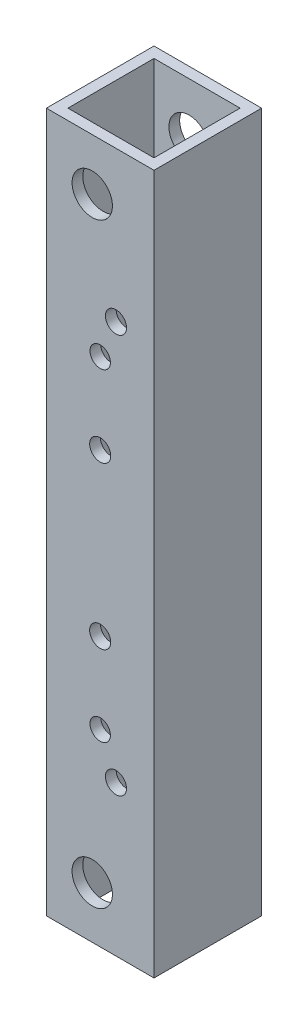
ISO-10303-21;
HEADER;
FILE_DESCRIPTION(('STEP AP214'),'2;1');
FILE_NAME('part.step','',(''),(''),'','','');
FILE_SCHEMA(('AUTOMOTIVE_DESIGN { 1 0 10303 214 1 1 1 1 }'));
ENDSEC;
DATA;
#1=APPLICATION_CONTEXT('core data for automotive mechanical design processes');
#2=APPLICATION_PROTOCOL_DEFINITION('international standard','automotive_design',2000,#1);
#3=PRODUCT_CONTEXT('',#1,'mechanical');
#4=PRODUCT('Part','Part','',(#3));
#5=PRODUCT_RELATED_PRODUCT_CATEGORY('part','',(#4));
#6=PRODUCT_DEFINITION_FORMATION('','',#4);
#7=PRODUCT_DEFINITION_CONTEXT('part definition',#1,'design');
#8=PRODUCT_DEFINITION('design','',#6,#7);
#9=PRODUCT_DEFINITION_SHAPE('','',#8);
#10=(LENGTH_UNIT() NAMED_UNIT(*) SI_UNIT(.MILLI.,.METRE.));
#11=(NAMED_UNIT(*) PLANE_ANGLE_UNIT() SI_UNIT($,.RADIAN.));
#12=(NAMED_UNIT(*) SI_UNIT($,.STERADIAN.) SOLID_ANGLE_UNIT());
#13=UNCERTAINTY_MEASURE_WITH_UNIT(LENGTH_MEASURE(1.E-05),#10,'distance_accuracy_value','');
#14=(GEOMETRIC_REPRESENTATION_CONTEXT(3) GLOBAL_UNCERTAINTY_ASSIGNED_CONTEXT((#13)) GLOBAL_UNIT_ASSIGNED_CONTEXT((#10,
#11,#12)) REPRESENTATION_CONTEXT('',''));
#15=CARTESIAN_POINT('',(0.,0.,0.));
#16=DIRECTION('',(0.,0.,1.));
#17=DIRECTION('',(1.,0.,0.));
#18=AXIS2_PLACEMENT_3D('',#15,#16,#17);
#19=CARTESIAN_POINT('',(25.4,0.,25.4));
#20=DIRECTION('',(0.,1.,0.));
#21=DIRECTION('',(-1.,0.,0.));
#22=AXIS2_PLACEMENT_3D('',#19,#20,#21);
#23=PLANE('',#22);
#24=DIRECTION('',(1.,0.,0.));
#25=VECTOR('',#24,1.);
#26=CARTESIAN_POINT('',(0.,0.,22.86));
#27=LINE('',#26,#25);
#28=CARTESIAN_POINT('',(2.54000000000001,0.,22.86));
#29=VERTEX_POINT('',#28);
#30=CARTESIAN_POINT('',(22.86,0.,22.86));
#31=VERTEX_POINT('',#30);
#32=EDGE_CURVE('E106',#29,#31,#27,.T.);
#33=ORIENTED_EDGE('',*,*,#32,.T.);
#34=DIRECTION('',(0.,0.,-1.));
#35=VECTOR('',#34,1.);
#36=CARTESIAN_POINT('',(22.86,0.,0.));
#37=LINE('',#36,#35);
#38=CARTESIAN_POINT('',(22.86,0.,2.54));
#39=VERTEX_POINT('',#38);
#40=EDGE_CURVE('E100',#31,#39,#37,.T.);
#41=ORIENTED_EDGE('',*,*,#40,.T.);
#42=DIRECTION('',(-1.,0.,0.));
#43=VECTOR('',#42,1.);
#44=CARTESIAN_POINT('',(0.,0.,2.54));
#45=LINE('',#44,#43);
#46=CARTESIAN_POINT('',(2.54,0.,2.54));
#47=VERTEX_POINT('',#46);
#48=EDGE_CURVE('E109',#39,#47,#45,.T.);
#49=ORIENTED_EDGE('',*,*,#48,.T.);
#50=DIRECTION('',(0.,0.,1.));
#51=VECTOR('',#50,1.);
#52=CARTESIAN_POINT('',(2.54,0.,0.));
#53=LINE('',#52,#51);
#54=EDGE_CURVE('E48',#47,#29,#53,.T.);
#55=ORIENTED_EDGE('',*,*,#54,.T.);
#56=EDGE_LOOP('',(#33,#41,#49,#55));
#57=FACE_BOUND('',#56,.T.);
#58=DIRECTION('',(1.,0.,0.));
#59=VECTOR('',#58,1.);
#60=CARTESIAN_POINT('',(25.4,0.,0.));
#61=LINE('',#60,#59);
#62=CARTESIAN_POINT('',(0.,0.,0.));
#63=VERTEX_POINT('',#62);
#64=CARTESIAN_POINT('',(25.4,0.,0.));
#65=VERTEX_POINT('',#64);
#66=EDGE_CURVE('E133',#63,#65,#61,.T.);
#67=ORIENTED_EDGE('',*,*,#66,.T.);
#68=DIRECTION('',(0.,0.,-1.));
#69=VECTOR('',#68,1.);
#70=CARTESIAN_POINT('',(25.4,0.,25.4));
#71=LINE('',#70,#69);
#72=CARTESIAN_POINT('',(25.4,0.,25.4));
#73=VERTEX_POINT('',#72);
#74=EDGE_CURVE('E11',#73,#65,#71,.T.);
#75=ORIENTED_EDGE('',*,*,#74,.F.);
#76=DIRECTION('',(1.,0.,0.));
#77=VECTOR('',#76,1.);
#78=CARTESIAN_POINT('',(25.4,0.,25.4));
#79=LINE('',#78,#77);
#80=CARTESIAN_POINT('',(0.,0.,25.4));
#81=VERTEX_POINT('',#80);
#82=EDGE_CURVE('E137',#81,#73,#79,.T.);
#83=ORIENTED_EDGE('',*,*,#82,.F.);
#84=DIRECTION('',(0.,0.,-1.));
#85=VECTOR('',#84,1.);
#86=CARTESIAN_POINT('',(0.,0.,25.4));
#87=LINE('',#86,#85);
#88=EDGE_CURVE('E147',#81,#63,#87,.T.);
#89=ORIENTED_EDGE('',*,*,#88,.T.);
#90=EDGE_LOOP('',(#67,#75,#83,#89));
#91=FACE_BOUND('',#90,.T.);
#92=ADVANCED_FACE('F32',(#57,#91),#23,.F.);
#93=CARTESIAN_POINT('',(25.4,165.1,25.4));
#94=DIRECTION('',(-1.,0.,0.));
#95=DIRECTION('',(0.,-1.,0.));
#96=AXIS2_PLACEMENT_3D('',#93,#94,#95);
#97=PLANE('',#96);
#98=DIRECTION('',(0.,1.,0.));
#99=VECTOR('',#98,1.);
#100=CARTESIAN_POINT('',(25.4,165.1,0.));
#101=LINE('',#100,#99);
#102=CARTESIAN_POINT('',(25.4,165.1,0.));
#103=VERTEX_POINT('',#102);
#104=EDGE_CURVE('E150',#65,#103,#101,.T.);
#105=ORIENTED_EDGE('',*,*,#104,.T.);
#106=DIRECTION('',(0.,0.,-1.));
#107=VECTOR('',#106,1.);
#108=CARTESIAN_POINT('',(25.4,165.1,25.4));
#109=LINE('',#108,#107);
#110=CARTESIAN_POINT('',(25.4,165.1,25.4));
#111=VERTEX_POINT('',#110);
#112=EDGE_CURVE('E40',#111,#103,#109,.T.);
#113=ORIENTED_EDGE('',*,*,#112,.F.);
#114=DIRECTION('',(0.,1.,0.));
#115=VECTOR('',#114,1.);
#116=CARTESIAN_POINT('',(25.4,165.1,25.4));
#117=LINE('',#116,#115);
#118=EDGE_CURVE('E140',#73,#111,#117,.T.);
#119=ORIENTED_EDGE('',*,*,#118,.F.);
#120=ORIENTED_EDGE('',*,*,#74,.T.);
#121=EDGE_LOOP('',(#105,#113,#119,#120));
#122=FACE_BOUND('',#121,.T.);
#123=ADVANCED_FACE('F233',(#122),#97,.F.);
#124=CARTESIAN_POINT('',(0.,165.1,25.4));
#125=DIRECTION('',(0.,-1.,0.));
#126=DIRECTION('',(0.,0.,-1.));
#127=AXIS2_PLACEMENT_3D('',#124,#125,#126);
#128=PLANE('',#127);
#129=DIRECTION('',(-1.,0.,0.));
#130=VECTOR('',#129,1.);
#131=CARTESIAN_POINT('',(0.,165.1,2.54));
#132=LINE('',#131,#130);
#133=CARTESIAN_POINT('',(22.86,165.1,2.54));
#134=VERTEX_POINT('',#133);
#135=CARTESIAN_POINT('',(2.54,165.1,2.54));
#136=VERTEX_POINT('',#135);
#137=EDGE_CURVE('E127',#134,#136,#132,.T.);
#138=ORIENTED_EDGE('',*,*,#137,.F.);
#139=DIRECTION('',(0.,0.,-1.));
#140=VECTOR('',#139,1.);
#141=CARTESIAN_POINT('',(22.86,165.1,0.));
#142=LINE('',#141,#140);
#143=CARTESIAN_POINT('',(22.86,165.1,22.86));
#144=VERTEX_POINT('',#143);
#145=EDGE_CURVE('E56',#144,#134,#142,.T.);
#146=ORIENTED_EDGE('',*,*,#145,.F.);
#147=DIRECTION('',(1.,0.,0.));
#148=VECTOR('',#147,1.);
#149=CARTESIAN_POINT('',(0.,165.1,22.86));
#150=LINE('',#149,#148);
#151=CARTESIAN_POINT('',(2.54000000000001,165.1,22.86));
#152=VERTEX_POINT('',#151);
#153=EDGE_CURVE('E115',#152,#144,#150,.T.);
#154=ORIENTED_EDGE('',*,*,#153,.F.);
#155=DIRECTION('',(0.,0.,1.));
#156=VECTOR('',#155,1.);
#157=CARTESIAN_POINT('',(2.54,165.1,0.));
#158=LINE('',#157,#156);
#159=EDGE_CURVE('E118',#136,#152,#158,.T.);
#160=ORIENTED_EDGE('',*,*,#159,.F.);
#161=EDGE_LOOP('',(#138,#146,#154,#160));
#162=FACE_BOUND('',#161,.T.);
#163=DIRECTION('',(-1.,0.,0.));
#164=VECTOR('',#163,1.);
#165=CARTESIAN_POINT('',(0.,165.1,0.));
#166=LINE('',#165,#164);
#167=CARTESIAN_POINT('',(0.,165.1,0.));
#168=VERTEX_POINT('',#167);
#169=EDGE_CURVE('E152',#103,#168,#166,.T.);
#170=ORIENTED_EDGE('',*,*,#169,.T.);
#171=DIRECTION('',(0.,0.,-1.));
#172=VECTOR('',#171,1.);
#173=CARTESIAN_POINT('',(0.,165.1,25.4));
#174=LINE('',#173,#172);
#175=CARTESIAN_POINT('',(0.,165.1,25.4));
#176=VERTEX_POINT('',#175);
#177=EDGE_CURVE('E157',#176,#168,#174,.T.);
#178=ORIENTED_EDGE('',*,*,#177,.F.);
#179=DIRECTION('',(-1.,0.,0.));
#180=VECTOR('',#179,1.);
#181=CARTESIAN_POINT('',(0.,165.1,25.4));
#182=LINE('',#181,#180);
#183=EDGE_CURVE('E143',#111,#176,#182,.T.);
#184=ORIENTED_EDGE('',*,*,#183,.F.);
#185=ORIENTED_EDGE('',*,*,#112,.T.);
#186=EDGE_LOOP('',(#170,#178,#184,#185));
#187=FACE_BOUND('',#186,.T.);
#188=ADVANCED_FACE('F238',(#162,#187),#128,.F.);
#189=CARTESIAN_POINT('',(0.,0.,25.4));
#190=DIRECTION('',(1.,0.,0.));
#191=DIRECTION('',(0.,0.,-1.));
#192=AXIS2_PLACEMENT_3D('',#189,#190,#191);
#193=PLANE('',#192);
#194=DIRECTION('',(0.,-1.,0.));
#195=VECTOR('',#194,1.);
#196=CARTESIAN_POINT('',(0.,0.,0.));
#197=LINE('',#196,#195);
#198=EDGE_CURVE('E141',#168,#63,#197,.T.);
#199=ORIENTED_EDGE('',*,*,#198,.T.);
#200=ORIENTED_EDGE('',*,*,#88,.F.);
#201=DIRECTION('',(0.,-1.,0.));
#202=VECTOR('',#201,1.);
#203=CARTESIAN_POINT('',(0.,0.,25.4));
#204=LINE('',#203,#202);
#205=EDGE_CURVE('E145',#176,#81,#204,.T.);
#206=ORIENTED_EDGE('',*,*,#205,.F.);
#207=ORIENTED_EDGE('',*,*,#177,.T.);
#208=EDGE_LOOP('',(#199,#200,#206,#207));
#209=FACE_BOUND('',#208,.T.);
#210=ADVANCED_FACE('F223',(#209),#193,.F.);
#211=CARTESIAN_POINT('',(0.,0.,25.4));
#212=DIRECTION('',(0.,0.,-1.));
#213=DIRECTION('',(-1.,0.,0.));
#214=AXIS2_PLACEMENT_3D('',#211,#212,#213);
#215=PLANE('',#214);
#216=CARTESIAN_POINT('',(16.4197438789308,129.630256121069,25.4));
#217=DIRECTION('',(0.,0.,1.));
#218=DIRECTION('',(1.,0.,0.));
#219=AXIS2_PLACEMENT_3D('',#216,#217,#218);
#220=CIRCLE('',#219,2.48919999999999);
#221=CARTESIAN_POINT('',(18.9089438789308,129.630256121069,25.4));
#222=VERTEX_POINT('',#221);
#223=EDGE_CURVE('E500',#222,#222,#220,.T.);
#224=ORIENTED_EDGE('',*,*,#223,.F.);
#225=EDGE_LOOP('',(#224));
#226=FACE_BOUND('',#225,.T.);
#227=CARTESIAN_POINT('',(12.7,120.65,25.4));
#228=DIRECTION('',(0.,0.,1.));
#229=DIRECTION('',(1.,0.,0.));
#230=AXIS2_PLACEMENT_3D('',#227,#228,#229);
#231=CIRCLE('',#230,2.41300000000005);
#232=CARTESIAN_POINT('',(15.113,120.65,25.4));
#233=VERTEX_POINT('',#232);
#234=EDGE_CURVE('E525',#233,#233,#231,.T.);
#235=ORIENTED_EDGE('',*,*,#234,.F.);
#236=EDGE_LOOP('',(#235));
#237=FACE_BOUND('',#236,.T.);
#238=CARTESIAN_POINT('',(12.7,101.6,25.4));
#239=DIRECTION('',(0.,0.,1.));
#240=DIRECTION('',(1.,0.,0.));
#241=AXIS2_PLACEMENT_3D('',#238,#239,#240);
#242=CIRCLE('',#241,2.4892);
#243=CARTESIAN_POINT('',(15.1892,101.6,25.4));
#244=VERTEX_POINT('',#243);
#245=EDGE_CURVE('E531',#244,#244,#242,.T.);
#246=ORIENTED_EDGE('',*,*,#245,.F.);
#247=EDGE_LOOP('',(#246));
#248=FACE_BOUND('',#247,.T.);
#249=CARTESIAN_POINT('',(16.4197438789309,35.4697438789308,25.4));
#250=DIRECTION('',(0.,0.,1.));
#251=DIRECTION('',(1.,0.,0.));
#252=AXIS2_PLACEMENT_3D('',#249,#250,#251);
#253=CIRCLE('',#252,2.48920000000001);
#254=CARTESIAN_POINT('',(18.9089438789309,35.4697438789308,25.4));
#255=VERTEX_POINT('',#254);
#256=EDGE_CURVE('E537',#255,#255,#253,.T.);
#257=ORIENTED_EDGE('',*,*,#256,.F.);
#258=EDGE_LOOP('',(#257));
#259=FACE_BOUND('',#258,.T.);
#260=CARTESIAN_POINT('',(12.7,44.45,25.4));
#261=DIRECTION('',(0.,0.,1.));
#262=DIRECTION('',(1.,0.,0.));
#263=AXIS2_PLACEMENT_3D('',#260,#261,#262);
#264=CIRCLE('',#263,2.41300000000008);
#265=CARTESIAN_POINT('',(15.1130000000001,44.45,25.4));
#266=VERTEX_POINT('',#265);
#267=EDGE_CURVE('E543',#266,#266,#264,.T.);
#268=ORIENTED_EDGE('',*,*,#267,.F.);
#269=EDGE_LOOP('',(#268));
#270=FACE_BOUND('',#269,.T.);
#271=CARTESIAN_POINT('',(12.7,63.4999999999999,25.4));
#272=DIRECTION('',(0.,0.,1.));
#273=DIRECTION('',(1.,0.,0.));
#274=AXIS2_PLACEMENT_3D('',#271,#272,#273);
#275=CIRCLE('',#274,2.48920000000002);
#276=CARTESIAN_POINT('',(15.1892,63.4999999999999,25.4));
#277=VERTEX_POINT('',#276);
#278=EDGE_CURVE('E516',#277,#277,#275,.T.);
#279=ORIENTED_EDGE('',*,*,#278,.F.);
#280=EDGE_LOOP('',(#279));
#281=FACE_BOUND('',#280,.T.);
#282=CARTESIAN_POINT('',(10.82039492,12.18999975,25.4));
#283=DIRECTION('',(0.,0.,-1.));
#284=DIRECTION('',(1.,0.,0.));
#285=AXIS2_PLACEMENT_3D('',#282,#283,#284);
#286=CIRCLE('',#285,4.7625);
#287=CARTESIAN_POINT('',(15.58289492,12.18999975,25.4));
#288=VERTEX_POINT('',#287);
#289=EDGE_CURVE('E204',#288,#288,#286,.T.);
#290=ORIENTED_EDGE('',*,*,#289,.T.);
#291=EDGE_LOOP('',(#290));
#292=FACE_BOUND('',#291,.T.);
#293=CARTESIAN_POINT('',(10.82039492,152.91000025,25.4));
#294=DIRECTION('',(0.,0.,1.));
#295=DIRECTION('',(1.,0.,0.));
#296=AXIS2_PLACEMENT_3D('',#293,#294,#295);
#297=CIRCLE('',#296,4.7625);
#298=CARTESIAN_POINT('',(15.58289492,152.91000025,25.4));
#299=VERTEX_POINT('',#298);
#300=EDGE_CURVE('E211',#299,#299,#297,.T.);
#301=ORIENTED_EDGE('',*,*,#300,.F.);
#302=EDGE_LOOP('',(#301));
#303=FACE_BOUND('',#302,.T.);
#304=ORIENTED_EDGE('',*,*,#82,.T.);
#305=ORIENTED_EDGE('',*,*,#118,.T.);
#306=ORIENTED_EDGE('',*,*,#183,.T.);
#307=ORIENTED_EDGE('',*,*,#205,.T.);
#308=EDGE_LOOP('',(#304,#305,#306,#307));
#309=FACE_BOUND('',#308,.T.);
#310=ADVANCED_FACE('F219',(#226,#237,#248,#259,#270,#281,#292,#303,#309),#215,.F.);
#311=CARTESIAN_POINT('',(0.,0.,0.));
#312=DIRECTION('',(0.,0.,-1.));
#313=DIRECTION('',(-1.,0.,0.));
#314=AXIS2_PLACEMENT_3D('',#311,#312,#313);
#315=PLANE('',#314);
#316=CARTESIAN_POINT('',(16.4197438789308,129.630256121069,0.));
#317=DIRECTION('',(0.,0.,1.));
#318=DIRECTION('',(1.,0.,0.));
#319=AXIS2_PLACEMENT_3D('',#316,#317,#318);
#320=CIRCLE('',#319,2.48919999999999);
#321=CARTESIAN_POINT('',(18.9089438789308,129.630256121069,0.));
#322=VERTEX_POINT('',#321);
#323=EDGE_CURVE('E523',#322,#322,#320,.T.);
#324=ORIENTED_EDGE('',*,*,#323,.T.);
#325=EDGE_LOOP('',(#324));
#326=FACE_BOUND('',#325,.T.);
#327=CARTESIAN_POINT('',(12.7,120.65,0.));
#328=DIRECTION('',(0.,0.,1.));
#329=DIRECTION('',(1.,0.,0.));
#330=AXIS2_PLACEMENT_3D('',#327,#328,#329);
#331=CIRCLE('',#330,2.41300000000005);
#332=CARTESIAN_POINT('',(15.113,120.65,0.));
#333=VERTEX_POINT('',#332);
#334=EDGE_CURVE('E528',#333,#333,#331,.T.);
#335=ORIENTED_EDGE('',*,*,#334,.T.);
#336=EDGE_LOOP('',(#335));
#337=FACE_BOUND('',#336,.T.);
#338=CARTESIAN_POINT('',(12.7,101.6,0.));
#339=DIRECTION('',(0.,0.,1.));
#340=DIRECTION('',(1.,0.,0.));
#341=AXIS2_PLACEMENT_3D('',#338,#339,#340);
#342=CIRCLE('',#341,2.4892);
#343=CARTESIAN_POINT('',(15.1892,101.6,0.));
#344=VERTEX_POINT('',#343);
#345=EDGE_CURVE('E534',#344,#344,#342,.T.);
#346=ORIENTED_EDGE('',*,*,#345,.T.);
#347=EDGE_LOOP('',(#346));
#348=FACE_BOUND('',#347,.T.);
#349=CARTESIAN_POINT('',(16.4197438789309,35.4697438789308,0.));
#350=DIRECTION('',(0.,0.,1.));
#351=DIRECTION('',(1.,0.,0.));
#352=AXIS2_PLACEMENT_3D('',#349,#350,#351);
#353=CIRCLE('',#352,2.48920000000001);
#354=CARTESIAN_POINT('',(18.9089438789309,35.4697438789308,0.));
#355=VERTEX_POINT('',#354);
#356=EDGE_CURVE('E540',#355,#355,#353,.T.);
#357=ORIENTED_EDGE('',*,*,#356,.T.);
#358=EDGE_LOOP('',(#357));
#359=FACE_BOUND('',#358,.T.);
#360=CARTESIAN_POINT('',(12.7,44.45,0.));
#361=DIRECTION('',(0.,0.,1.));
#362=DIRECTION('',(1.,0.,0.));
#363=AXIS2_PLACEMENT_3D('',#360,#361,#362);
#364=CIRCLE('',#363,2.41300000000008);
#365=CARTESIAN_POINT('',(15.1130000000001,44.45,0.));
#366=VERTEX_POINT('',#365);
#367=EDGE_CURVE('E519',#366,#366,#364,.T.);
#368=ORIENTED_EDGE('',*,*,#367,.T.);
#369=EDGE_LOOP('',(#368));
#370=FACE_BOUND('',#369,.T.);
#371=CARTESIAN_POINT('',(12.7,63.4999999999999,0.));
#372=DIRECTION('',(0.,0.,1.));
#373=DIRECTION('',(1.,0.,0.));
#374=AXIS2_PLACEMENT_3D('',#371,#372,#373);
#375=CIRCLE('',#374,2.48920000000002);
#376=CARTESIAN_POINT('',(15.1892,63.4999999999999,0.));
#377=VERTEX_POINT('',#376);
#378=EDGE_CURVE('E175',#377,#377,#375,.T.);
#379=ORIENTED_EDGE('',*,*,#378,.T.);
#380=EDGE_LOOP('',(#379));
#381=FACE_BOUND('',#380,.T.);
#382=CARTESIAN_POINT('',(10.82039492,12.18999975,0.));
#383=DIRECTION('',(0.,0.,-1.));
#384=DIRECTION('',(1.,0.,0.));
#385=AXIS2_PLACEMENT_3D('',#382,#383,#384);
#386=CIRCLE('',#385,4.7625);
#387=CARTESIAN_POINT('',(15.58289492,12.18999975,0.));
#388=VERTEX_POINT('',#387);
#389=EDGE_CURVE('E170',#388,#388,#386,.T.);
#390=ORIENTED_EDGE('',*,*,#389,.F.);
#391=EDGE_LOOP('',(#390));
#392=FACE_BOUND('',#391,.T.);
#393=CARTESIAN_POINT('',(10.82039492,152.91000025,0.));
#394=DIRECTION('',(0.,0.,1.));
#395=DIRECTION('',(1.,0.,0.));
#396=AXIS2_PLACEMENT_3D('',#393,#394,#395);
#397=CIRCLE('',#396,4.7625);
#398=CARTESIAN_POINT('',(15.58289492,152.91000025,0.));
#399=VERTEX_POINT('',#398);
#400=EDGE_CURVE('E165',#399,#399,#397,.T.);
#401=ORIENTED_EDGE('',*,*,#400,.T.);
#402=EDGE_LOOP('',(#401));
#403=FACE_BOUND('',#402,.T.);
#404=ORIENTED_EDGE('',*,*,#66,.F.);
#405=ORIENTED_EDGE('',*,*,#198,.F.);
#406=ORIENTED_EDGE('',*,*,#169,.F.);
#407=ORIENTED_EDGE('',*,*,#104,.F.);
#408=EDGE_LOOP('',(#404,#405,#406,#407));
#409=FACE_BOUND('',#408,.T.);
#410=ADVANCED_FACE('F222',(#326,#337,#348,#359,#370,#381,#392,#403,#409),#315,.T.);
#411=CARTESIAN_POINT('',(22.86,0.,0.));
#412=DIRECTION('',(1.,0.,0.));
#413=DIRECTION('',(0.,0.,-1.));
#414=AXIS2_PLACEMENT_3D('',#411,#412,#413);
#415=PLANE('',#414);
#416=ORIENTED_EDGE('',*,*,#145,.T.);
#417=DIRECTION('',(0.,1.,0.));
#418=VECTOR('',#417,1.);
#419=CARTESIAN_POINT('',(22.86,0.,2.54));
#420=LINE('',#419,#418);
#421=EDGE_CURVE('E96',#39,#134,#420,.T.);
#422=ORIENTED_EDGE('',*,*,#421,.F.);
#423=ORIENTED_EDGE('',*,*,#40,.F.);
#424=DIRECTION('',(0.,1.,0.));
#425=VECTOR('',#424,1.);
#426=CARTESIAN_POINT('',(22.86,0.,22.86));
#427=LINE('',#426,#425);
#428=EDGE_CURVE('E131',#31,#144,#427,.T.);
#429=ORIENTED_EDGE('',*,*,#428,.T.);
#430=EDGE_LOOP('',(#416,#422,#423,#429));
#431=FACE_BOUND('',#430,.T.);
#432=ADVANCED_FACE('F98',(#431),#415,.F.);
#433=CARTESIAN_POINT('',(0.,0.,22.86));
#434=DIRECTION('',(0.,0.,1.));
#435=DIRECTION('',(1.,0.,0.));
#436=AXIS2_PLACEMENT_3D('',#433,#434,#435);
#437=PLANE('',#436);
#438=CARTESIAN_POINT('',(16.4197438789308,129.630256121069,22.86));
#439=DIRECTION('',(0.,0.,1.));
#440=DIRECTION('',(1.,0.,0.));
#441=AXIS2_PLACEMENT_3D('',#438,#439,#440);
#442=CIRCLE('',#441,2.48919999999999);
#443=CARTESIAN_POINT('',(18.9089438789308,129.630256121069,22.86));
#444=VERTEX_POINT('',#443);
#445=EDGE_CURVE('E201',#444,#444,#442,.T.);
#446=ORIENTED_EDGE('',*,*,#445,.T.);
#447=EDGE_LOOP('',(#446));
#448=FACE_BOUND('',#447,.T.);
#449=CARTESIAN_POINT('',(12.7,120.65,22.86));
#450=DIRECTION('',(0.,0.,1.));
#451=DIRECTION('',(1.,0.,0.));
#452=AXIS2_PLACEMENT_3D('',#449,#450,#451);
#453=CIRCLE('',#452,2.41300000000005);
#454=CARTESIAN_POINT('',(15.113,120.65,22.86));
#455=VERTEX_POINT('',#454);
#456=EDGE_CURVE('E189',#455,#455,#453,.T.);
#457=ORIENTED_EDGE('',*,*,#456,.T.);
#458=EDGE_LOOP('',(#457));
#459=FACE_BOUND('',#458,.T.);
#460=CARTESIAN_POINT('',(12.7,101.6,22.86));
#461=DIRECTION('',(0.,0.,1.));
#462=DIRECTION('',(1.,0.,0.));
#463=AXIS2_PLACEMENT_3D('',#460,#461,#462);
#464=CIRCLE('',#463,2.4892);
#465=CARTESIAN_POINT('',(15.1892,101.6,22.86));
#466=VERTEX_POINT('',#465);
#467=EDGE_CURVE('E186',#466,#466,#464,.T.);
#468=ORIENTED_EDGE('',*,*,#467,.T.);
#469=EDGE_LOOP('',(#468));
#470=FACE_BOUND('',#469,.T.);
#471=CARTESIAN_POINT('',(16.4197438789309,35.4697438789308,22.86));
#472=DIRECTION('',(0.,0.,1.));
#473=DIRECTION('',(1.,0.,0.));
#474=AXIS2_PLACEMENT_3D('',#471,#472,#473);
#475=CIRCLE('',#474,2.48920000000001);
#476=CARTESIAN_POINT('',(18.9089438789309,35.4697438789308,22.86));
#477=VERTEX_POINT('',#476);
#478=EDGE_CURVE('E183',#477,#477,#475,.T.);
#479=ORIENTED_EDGE('',*,*,#478,.T.);
#480=EDGE_LOOP('',(#479));
#481=FACE_BOUND('',#480,.T.);
#482=CARTESIAN_POINT('',(12.7,44.45,22.86));
#483=DIRECTION('',(0.,0.,1.));
#484=DIRECTION('',(1.,0.,0.));
#485=AXIS2_PLACEMENT_3D('',#482,#483,#484);
#486=CIRCLE('',#485,2.41300000000008);
#487=CARTESIAN_POINT('',(15.1130000000001,44.45,22.86));
#488=VERTEX_POINT('',#487);
#489=EDGE_CURVE('E179',#488,#488,#486,.T.);
#490=ORIENTED_EDGE('',*,*,#489,.T.);
#491=EDGE_LOOP('',(#490));
#492=FACE_BOUND('',#491,.T.);
#493=CARTESIAN_POINT('',(12.7,63.4999999999999,22.86));
#494=DIRECTION('',(0.,0.,1.));
#495=DIRECTION('',(1.,0.,0.));
#496=AXIS2_PLACEMENT_3D('',#493,#494,#495);
#497=CIRCLE('',#496,2.48920000000002);
#498=CARTESIAN_POINT('',(15.1892,63.4999999999999,22.86));
#499=VERTEX_POINT('',#498);
#500=EDGE_CURVE('E174',#499,#499,#497,.T.);
#501=ORIENTED_EDGE('',*,*,#500,.T.);
#502=EDGE_LOOP('',(#501));
#503=FACE_BOUND('',#502,.T.);
#504=CARTESIAN_POINT('',(10.82039492,12.18999975,22.86));
#505=DIRECTION('',(0.,0.,1.));
#506=DIRECTION('',(1.,0.,0.));
#507=AXIS2_PLACEMENT_3D('',#504,#505,#506);
#508=CIRCLE('',#507,4.7625);
#509=CARTESIAN_POINT('',(15.58289492,12.18999975,22.86));
#510=VERTEX_POINT('',#509);
#511=EDGE_CURVE('E169',#510,#510,#508,.F.);
#512=ORIENTED_EDGE('',*,*,#511,.F.);
#513=EDGE_LOOP('',(#512));
#514=FACE_BOUND('',#513,.T.);
#515=CARTESIAN_POINT('',(10.82039492,152.91000025,22.86));
#516=DIRECTION('',(0.,0.,1.));
#517=DIRECTION('',(1.,0.,0.));
#518=AXIS2_PLACEMENT_3D('',#515,#516,#517);
#519=CIRCLE('',#518,4.7625);
#520=CARTESIAN_POINT('',(15.58289492,152.91000025,22.86));
#521=VERTEX_POINT('',#520);
#522=EDGE_CURVE('E121',#521,#521,#519,.T.);
#523=ORIENTED_EDGE('',*,*,#522,.T.);
#524=EDGE_LOOP('',(#523));
#525=FACE_BOUND('',#524,.T.);
#526=ORIENTED_EDGE('',*,*,#153,.T.);
#527=ORIENTED_EDGE('',*,*,#428,.F.);
#528=ORIENTED_EDGE('',*,*,#32,.F.);
#529=DIRECTION('',(0.,1.,0.));
#530=VECTOR('',#529,1.);
#531=CARTESIAN_POINT('',(2.54000000000001,0.,22.86));
#532=LINE('',#531,#530);
#533=EDGE_CURVE('E134',#29,#152,#532,.T.);
#534=ORIENTED_EDGE('',*,*,#533,.T.);
#535=EDGE_LOOP('',(#526,#527,#528,#534));
#536=FACE_BOUND('',#535,.T.);
#537=ADVANCED_FACE('F248',(#448,#459,#470,#481,#492,#503,#514,#525,#536),#437,.F.);
#538=CARTESIAN_POINT('',(2.54,0.,0.));
#539=DIRECTION('',(-1.,0.,0.));
#540=DIRECTION('',(0.,0.,1.));
#541=AXIS2_PLACEMENT_3D('',#538,#539,#540);
#542=PLANE('',#541);
#543=ORIENTED_EDGE('',*,*,#159,.T.);
#544=ORIENTED_EDGE('',*,*,#533,.F.);
#545=ORIENTED_EDGE('',*,*,#54,.F.);
#546=DIRECTION('',(0.,1.,0.));
#547=VECTOR('',#546,1.);
#548=CARTESIAN_POINT('',(2.54,0.,2.54));
#549=LINE('',#548,#547);
#550=EDGE_CURVE('E105',#47,#136,#549,.T.);
#551=ORIENTED_EDGE('',*,*,#550,.T.);
#552=EDGE_LOOP('',(#543,#544,#545,#551));
#553=FACE_BOUND('',#552,.T.);
#554=ADVANCED_FACE('F291',(#553),#542,.F.);
#555=CARTESIAN_POINT('',(0.,0.,2.54));
#556=DIRECTION('',(0.,0.,-1.));
#557=DIRECTION('',(-1.,0.,0.));
#558=AXIS2_PLACEMENT_3D('',#555,#556,#557);
#559=PLANE('',#558);
#560=CARTESIAN_POINT('',(16.4197438789308,129.630256121069,2.54));
#561=DIRECTION('',(0.,0.,-1.));
#562=DIRECTION('',(-1.,0.,0.));
#563=AXIS2_PLACEMENT_3D('',#560,#561,#562);
#564=CIRCLE('',#563,2.48919999999999);
#565=CARTESIAN_POINT('',(13.9305438789308,129.630256121069,2.54));
#566=VERTEX_POINT('',#565);
#567=EDGE_CURVE('E35',#566,#566,#564,.T.);
#568=ORIENTED_EDGE('',*,*,#567,.T.);
#569=EDGE_LOOP('',(#568));
#570=FACE_BOUND('',#569,.T.);
#571=CARTESIAN_POINT('',(12.7,120.65,2.54));
#572=DIRECTION('',(0.,0.,-1.));
#573=DIRECTION('',(-1.,0.,0.));
#574=AXIS2_PLACEMENT_3D('',#571,#572,#573);
#575=CIRCLE('',#574,2.41300000000005);
#576=CARTESIAN_POINT('',(10.2869999999999,120.65,2.54));
#577=VERTEX_POINT('',#576);
#578=EDGE_CURVE('E187',#577,#577,#575,.T.);
#579=ORIENTED_EDGE('',*,*,#578,.T.);
#580=EDGE_LOOP('',(#579));
#581=FACE_BOUND('',#580,.T.);
#582=CARTESIAN_POINT('',(12.7,101.6,2.54));
#583=DIRECTION('',(0.,0.,-1.));
#584=DIRECTION('',(-1.,0.,0.));
#585=AXIS2_PLACEMENT_3D('',#582,#583,#584);
#586=CIRCLE('',#585,2.4892);
#587=CARTESIAN_POINT('',(10.2108,101.6,2.54));
#588=VERTEX_POINT('',#587);
#589=EDGE_CURVE('E184',#588,#588,#586,.T.);
#590=ORIENTED_EDGE('',*,*,#589,.T.);
#591=EDGE_LOOP('',(#590));
#592=FACE_BOUND('',#591,.T.);
#593=CARTESIAN_POINT('',(16.4197438789309,35.4697438789308,2.54));
#594=DIRECTION('',(0.,0.,-1.));
#595=DIRECTION('',(-1.,0.,0.));
#596=AXIS2_PLACEMENT_3D('',#593,#594,#595);
#597=CIRCLE('',#596,2.48920000000001);
#598=CARTESIAN_POINT('',(13.9305438789308,35.4697438789308,2.54));
#599=VERTEX_POINT('',#598);
#600=EDGE_CURVE('E180',#599,#599,#597,.T.);
#601=ORIENTED_EDGE('',*,*,#600,.T.);
#602=EDGE_LOOP('',(#601));
#603=FACE_BOUND('',#602,.T.);
#604=CARTESIAN_POINT('',(12.7,44.45,2.54));
#605=DIRECTION('',(0.,0.,-1.));
#606=DIRECTION('',(-1.,0.,0.));
#607=AXIS2_PLACEMENT_3D('',#604,#605,#606);
#608=CIRCLE('',#607,2.41300000000008);
#609=CARTESIAN_POINT('',(10.2869999999999,44.45,2.54));
#610=VERTEX_POINT('',#609);
#611=EDGE_CURVE('E176',#610,#610,#608,.T.);
#612=ORIENTED_EDGE('',*,*,#611,.T.);
#613=EDGE_LOOP('',(#612));
#614=FACE_BOUND('',#613,.T.);
#615=CARTESIAN_POINT('',(12.7,63.4999999999999,2.54));
#616=DIRECTION('',(0.,0.,-1.));
#617=DIRECTION('',(-1.,0.,0.));
#618=AXIS2_PLACEMENT_3D('',#615,#616,#617);
#619=CIRCLE('',#618,2.48920000000002);
#620=CARTESIAN_POINT('',(10.2108,63.4999999999999,2.54));
#621=VERTEX_POINT('',#620);
#622=EDGE_CURVE('E171',#621,#621,#619,.T.);
#623=ORIENTED_EDGE('',*,*,#622,.T.);
#624=EDGE_LOOP('',(#623));
#625=FACE_BOUND('',#624,.T.);
#626=CARTESIAN_POINT('',(10.82039492,12.18999975,2.54));
#627=DIRECTION('',(0.,0.,-1.));
#628=DIRECTION('',(-1.,0.,0.));
#629=AXIS2_PLACEMENT_3D('',#626,#627,#628);
#630=CIRCLE('',#629,4.7625);
#631=CARTESIAN_POINT('',(6.05789491999999,12.18999975,2.54));
#632=VERTEX_POINT('',#631);
#633=EDGE_CURVE('E166',#632,#632,#630,.F.);
#634=ORIENTED_EDGE('',*,*,#633,.F.);
#635=EDGE_LOOP('',(#634));
#636=FACE_BOUND('',#635,.T.);
#637=CARTESIAN_POINT('',(10.82039492,152.91000025,2.54));
#638=DIRECTION('',(0.,0.,-1.));
#639=DIRECTION('',(-1.,0.,0.));
#640=AXIS2_PLACEMENT_3D('',#637,#638,#639);
#641=CIRCLE('',#640,4.7625);
#642=CARTESIAN_POINT('',(6.05789492000001,152.91000025,2.54));
#643=VERTEX_POINT('',#642);
#644=EDGE_CURVE('E162',#643,#643,#641,.T.);
#645=ORIENTED_EDGE('',*,*,#644,.T.);
#646=EDGE_LOOP('',(#645));
#647=FACE_BOUND('',#646,.T.);
#648=ORIENTED_EDGE('',*,*,#137,.T.);
#649=ORIENTED_EDGE('',*,*,#550,.F.);
#650=ORIENTED_EDGE('',*,*,#48,.F.);
#651=ORIENTED_EDGE('',*,*,#421,.T.);
#652=EDGE_LOOP('',(#648,#649,#650,#651));
#653=FACE_BOUND('',#652,.T.);
#654=ADVANCED_FACE('F110',(#570,#581,#592,#603,#614,#625,#636,#647,#653),#559,.F.);
#655=CARTESIAN_POINT('',(10.82039492,152.91000025,0.));
#656=DIRECTION('',(0.,0.,1.));
#657=DIRECTION('',(1.,0.,0.));
#658=AXIS2_PLACEMENT_3D('',#655,#656,#657);
#659=CYLINDRICAL_SURFACE('',#658,4.7625);
#660=ORIENTED_EDGE('',*,*,#400,.F.);
#661=EDGE_LOOP('',(#660));
#662=FACE_BOUND('',#661,.T.);
#663=ORIENTED_EDGE('',*,*,#644,.F.);
#664=EDGE_LOOP('',(#663));
#665=FACE_BOUND('',#664,.T.);
#666=ADVANCED_FACE('F303',(#662,#665),#659,.F.);
#667=ORIENTED_EDGE('',*,*,#300,.T.);
#668=EDGE_LOOP('',(#667));
#669=FACE_BOUND('',#668,.T.);
#670=ORIENTED_EDGE('',*,*,#522,.F.);
#671=EDGE_LOOP('',(#670));
#672=FACE_BOUND('',#671,.T.);
#673=ADVANCED_FACE('F216',(#669,#672),#659,.F.);
#674=CARTESIAN_POINT('',(10.82039492,12.18999975,0.));
#675=DIRECTION('',(0.,0.,1.));
#676=DIRECTION('',(1.,0.,0.));
#677=AXIS2_PLACEMENT_3D('',#674,#675,#676);
#678=CYLINDRICAL_SURFACE('',#677,4.7625);
#679=ORIENTED_EDGE('',*,*,#389,.T.);
#680=EDGE_LOOP('',(#679));
#681=FACE_BOUND('',#680,.T.);
#682=ORIENTED_EDGE('',*,*,#633,.T.);
#683=EDGE_LOOP('',(#682));
#684=FACE_BOUND('',#683,.T.);
#685=ADVANCED_FACE('F428',(#681,#684),#678,.F.);
#686=ORIENTED_EDGE('',*,*,#289,.F.);
#687=EDGE_LOOP('',(#686));
#688=FACE_BOUND('',#687,.T.);
#689=ORIENTED_EDGE('',*,*,#511,.T.);
#690=EDGE_LOOP('',(#689));
#691=FACE_BOUND('',#690,.T.);
#692=ADVANCED_FACE('F277',(#688,#691),#678,.F.);
#693=CARTESIAN_POINT('',(12.7,63.4999999999999,0.));
#694=DIRECTION('',(0.,0.,1.));
#695=DIRECTION('',(1.,0.,0.));
#696=AXIS2_PLACEMENT_3D('',#693,#694,#695);
#697=CYLINDRICAL_SURFACE('',#696,2.48920000000002);
#698=ORIENTED_EDGE('',*,*,#378,.F.);
#699=EDGE_LOOP('',(#698));
#700=FACE_BOUND('',#699,.T.);
#701=ORIENTED_EDGE('',*,*,#622,.F.);
#702=EDGE_LOOP('',(#701));
#703=FACE_BOUND('',#702,.T.);
#704=ADVANCED_FACE('F311',(#700,#703),#697,.F.);
#705=CARTESIAN_POINT('',(12.7,44.45,0.));
#706=DIRECTION('',(0.,0.,1.));
#707=DIRECTION('',(1.,0.,0.));
#708=AXIS2_PLACEMENT_3D('',#705,#706,#707);
#709=CYLINDRICAL_SURFACE('',#708,2.41300000000008);
#710=ORIENTED_EDGE('',*,*,#367,.F.);
#711=EDGE_LOOP('',(#710));
#712=FACE_BOUND('',#711,.T.);
#713=ORIENTED_EDGE('',*,*,#611,.F.);
#714=EDGE_LOOP('',(#713));
#715=FACE_BOUND('',#714,.T.);
#716=ADVANCED_FACE('F316',(#712,#715),#709,.F.);
#717=CARTESIAN_POINT('',(16.4197438789309,35.4697438789308,0.));
#718=DIRECTION('',(0.,0.,1.));
#719=DIRECTION('',(1.,0.,0.));
#720=AXIS2_PLACEMENT_3D('',#717,#718,#719);
#721=CYLINDRICAL_SURFACE('',#720,2.48920000000001);
#722=ORIENTED_EDGE('',*,*,#356,.F.);
#723=EDGE_LOOP('',(#722));
#724=FACE_BOUND('',#723,.T.);
#725=ORIENTED_EDGE('',*,*,#600,.F.);
#726=EDGE_LOOP('',(#725));
#727=FACE_BOUND('',#726,.T.);
#728=ADVANCED_FACE('F327',(#724,#727),#721,.F.);
#729=CARTESIAN_POINT('',(12.7,101.6,0.));
#730=DIRECTION('',(0.,0.,1.));
#731=DIRECTION('',(1.,0.,0.));
#732=AXIS2_PLACEMENT_3D('',#729,#730,#731);
#733=CYLINDRICAL_SURFACE('',#732,2.4892);
#734=ORIENTED_EDGE('',*,*,#345,.F.);
#735=EDGE_LOOP('',(#734));
#736=FACE_BOUND('',#735,.T.);
#737=ORIENTED_EDGE('',*,*,#589,.F.);
#738=EDGE_LOOP('',(#737));
#739=FACE_BOUND('',#738,.T.);
#740=ADVANCED_FACE('F338',(#736,#739),#733,.F.);
#741=CARTESIAN_POINT('',(12.7,120.65,0.));
#742=DIRECTION('',(0.,0.,1.));
#743=DIRECTION('',(1.,0.,0.));
#744=AXIS2_PLACEMENT_3D('',#741,#742,#743);
#745=CYLINDRICAL_SURFACE('',#744,2.41300000000005);
#746=ORIENTED_EDGE('',*,*,#334,.F.);
#747=EDGE_LOOP('',(#746));
#748=FACE_BOUND('',#747,.T.);
#749=ORIENTED_EDGE('',*,*,#578,.F.);
#750=EDGE_LOOP('',(#749));
#751=FACE_BOUND('',#750,.T.);
#752=ADVANCED_FACE('F349',(#748,#751),#745,.F.);
#753=CARTESIAN_POINT('',(16.4197438789308,129.630256121069,0.));
#754=DIRECTION('',(0.,0.,1.));
#755=DIRECTION('',(1.,0.,0.));
#756=AXIS2_PLACEMENT_3D('',#753,#754,#755);
#757=CYLINDRICAL_SURFACE('',#756,2.48919999999999);
#758=ORIENTED_EDGE('',*,*,#323,.F.);
#759=EDGE_LOOP('',(#758));
#760=FACE_BOUND('',#759,.T.);
#761=ORIENTED_EDGE('',*,*,#567,.F.);
#762=EDGE_LOOP('',(#761));
#763=FACE_BOUND('',#762,.T.);
#764=ADVANCED_FACE('F360',(#760,#763),#757,.F.);
#765=ORIENTED_EDGE('',*,*,#278,.T.);
#766=EDGE_LOOP('',(#765));
#767=FACE_BOUND('',#766,.T.);
#768=ORIENTED_EDGE('',*,*,#500,.F.);
#769=EDGE_LOOP('',(#768));
#770=FACE_BOUND('',#769,.T.);
#771=ADVANCED_FACE('F319',(#767,#770),#697,.F.);
#772=ORIENTED_EDGE('',*,*,#267,.T.);
#773=EDGE_LOOP('',(#772));
#774=FACE_BOUND('',#773,.T.);
#775=ORIENTED_EDGE('',*,*,#489,.F.);
#776=EDGE_LOOP('',(#775));
#777=FACE_BOUND('',#776,.T.);
#778=ADVANCED_FACE('F330',(#774,#777),#709,.F.);
#779=ORIENTED_EDGE('',*,*,#256,.T.);
#780=EDGE_LOOP('',(#779));
#781=FACE_BOUND('',#780,.T.);
#782=ORIENTED_EDGE('',*,*,#478,.F.);
#783=EDGE_LOOP('',(#782));
#784=FACE_BOUND('',#783,.T.);
#785=ADVANCED_FACE('F341',(#781,#784),#721,.F.);
#786=ORIENTED_EDGE('',*,*,#245,.T.);
#787=EDGE_LOOP('',(#786));
#788=FACE_BOUND('',#787,.T.);
#789=ORIENTED_EDGE('',*,*,#467,.F.);
#790=EDGE_LOOP('',(#789));
#791=FACE_BOUND('',#790,.T.);
#792=ADVANCED_FACE('F352',(#788,#791),#733,.F.);
#793=ORIENTED_EDGE('',*,*,#234,.T.);
#794=EDGE_LOOP('',(#793));
#795=FACE_BOUND('',#794,.T.);
#796=ORIENTED_EDGE('',*,*,#456,.F.);
#797=EDGE_LOOP('',(#796));
#798=FACE_BOUND('',#797,.T.);
#799=ADVANCED_FACE('F363',(#795,#798),#745,.F.);
#800=ORIENTED_EDGE('',*,*,#223,.T.);
#801=EDGE_LOOP('',(#800));
#802=FACE_BOUND('',#801,.T.);
#803=ORIENTED_EDGE('',*,*,#445,.F.);
#804=EDGE_LOOP('',(#803));
#805=FACE_BOUND('',#804,.T.);
#806=ADVANCED_FACE('F373',(#802,#805),#757,.F.);
#807=CLOSED_SHELL('',(#92,#123,#188,#210,#310,#410,#432,#537,#554,#654,#666,#673,#685,#692,#704,
#716,#728,#740,#752,#764,#771,#778,#785,#792,#799,#806));
#808=MANIFOLD_SOLID_BREP('B2',#807);
#809=ADVANCED_BREP_SHAPE_REPRESENTATION('',(#18,#808),#14);
#810=SHAPE_DEFINITION_REPRESENTATION(#9,#809);
ENDSEC;
END-ISO-10303-21;
